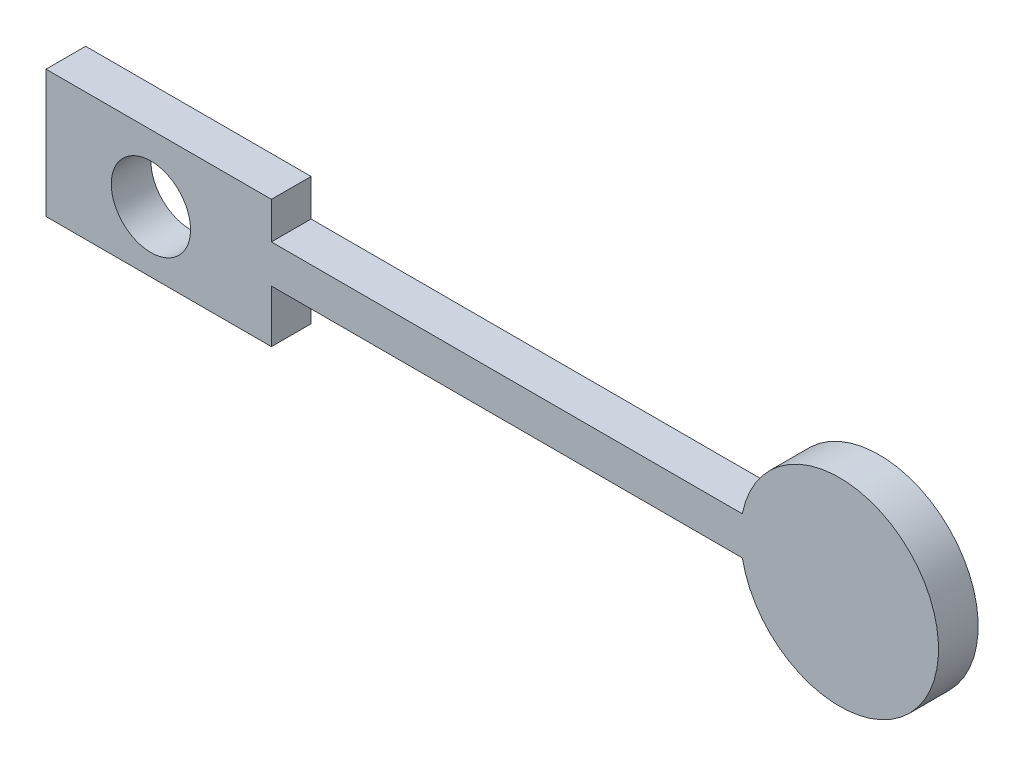
ISO-10303-21;
HEADER;
FILE_DESCRIPTION(('STEP AP214'),'2;1');
FILE_NAME('part.step','',(''),(''),'','','');
FILE_SCHEMA(('AUTOMOTIVE_DESIGN { 1 0 10303 214 1 1 1 1 }'));
ENDSEC;
DATA;
#1=APPLICATION_CONTEXT('core data for automotive mechanical design processes');
#2=APPLICATION_PROTOCOL_DEFINITION('international standard','automotive_design',2000,#1);
#3=PRODUCT_CONTEXT('',#1,'mechanical');
#4=PRODUCT('Part','Part','',(#3));
#5=PRODUCT_RELATED_PRODUCT_CATEGORY('part','',(#4));
#6=PRODUCT_DEFINITION_FORMATION('','',#4);
#7=PRODUCT_DEFINITION_CONTEXT('part definition',#1,'design');
#8=PRODUCT_DEFINITION('design','',#6,#7);
#9=PRODUCT_DEFINITION_SHAPE('','',#8);
#10=(LENGTH_UNIT() NAMED_UNIT(*) SI_UNIT(.MILLI.,.METRE.));
#11=(NAMED_UNIT(*) PLANE_ANGLE_UNIT() SI_UNIT($,.RADIAN.));
#12=(NAMED_UNIT(*) SI_UNIT($,.STERADIAN.) SOLID_ANGLE_UNIT());
#13=UNCERTAINTY_MEASURE_WITH_UNIT(LENGTH_MEASURE(1.E-05),#10,'distance_accuracy_value','');
#14=(GEOMETRIC_REPRESENTATION_CONTEXT(3) GLOBAL_UNCERTAINTY_ASSIGNED_CONTEXT((#13)) GLOBAL_UNIT_ASSIGNED_CONTEXT((#10,
#11,#12)) REPRESENTATION_CONTEXT('',''));
#15=CARTESIAN_POINT('',(0.,0.,0.));
#16=DIRECTION('',(0.,0.,1.));
#17=DIRECTION('',(1.,0.,0.));
#18=AXIS2_PLACEMENT_3D('',#15,#16,#17);
#19=CARTESIAN_POINT('',(173.72990017453,2.71115254064391,10.));
#20=DIRECTION('',(0.,0.,1.));
#21=DIRECTION('',(1.,0.,0.));
#22=AXIS2_PLACEMENT_3D('',#19,#20,#21);
#23=PLANE('',#22);
#24=DIRECTION('',(0.,-1.,0.));
#25=VECTOR('',#24,1.);
#26=CARTESIAN_POINT('',(-26.4633372645644,-15.3598391116003,10.));
#27=LINE('',#26,#25);
#28=CARTESIAN_POINT('',(-26.4633372645644,16.8403055319955,10.));
#29=VERTEX_POINT('',#28);
#30=CARTESIAN_POINT('',(-26.4633372645644,-15.3598391116003,10.));
#31=VERTEX_POINT('',#30);
#32=EDGE_CURVE('E147',#29,#31,#27,.T.);
#33=ORIENTED_EDGE('',*,*,#32,.T.);
#34=DIRECTION('',(1.,0.,0.));
#35=VECTOR('',#34,1.);
#36=CARTESIAN_POINT('',(-26.4633372645644,-15.3598391116003,10.));
#37=LINE('',#36,#35);
#38=CARTESIAN_POINT('',(30.4099834203681,-15.3598391116003,10.));
#39=VERTEX_POINT('',#38);
#40=EDGE_CURVE('E95',#31,#39,#37,.T.);
#41=ORIENTED_EDGE('',*,*,#40,.T.);
#42=DIRECTION('',(0.,1.,0.));
#43=VECTOR('',#42,1.);
#44=CARTESIAN_POINT('',(30.4099834203681,-15.3598391116003,10.));
#45=LINE('',#44,#43);
#46=CARTESIAN_POINT('',(30.4099834203681,-2.10831855037226,10.));
#47=VERTEX_POINT('',#46);
#48=EDGE_CURVE('E162',#39,#47,#45,.T.);
#49=ORIENTED_EDGE('',*,*,#48,.T.);
#50=DIRECTION('',(1.,0.,0.));
#51=VECTOR('',#50,1.);
#52=CARTESIAN_POINT('',(30.4099834203681,-2.10831855037226,10.));
#53=LINE('',#52,#51);
#54=CARTESIAN_POINT('',(149.211555261878,-2.10831855037226,10.));
#55=VERTEX_POINT('',#54);
#56=EDGE_CURVE('E175',#47,#55,#53,.T.);
#57=ORIENTED_EDGE('',*,*,#56,.T.);
#58=CARTESIAN_POINT('',(173.72990017453,2.71115254064391,10.));
#59=DIRECTION('',(0.,0.,1.));
#60=DIRECTION('',(1.,0.,0.));
#61=AXIS2_PLACEMENT_3D('',#58,#59,#60);
#62=CIRCLE('',#61,24.9875276658761);
#63=CARTESIAN_POINT('',(149.211555261878,7.53062363166009,10.));
#64=VERTEX_POINT('',#63);
#65=EDGE_CURVE('E114',#55,#64,#62,.T.);
#66=ORIENTED_EDGE('',*,*,#65,.T.);
#67=DIRECTION('',(-1.,0.,0.));
#68=VECTOR('',#67,1.);
#69=CARTESIAN_POINT('',(30.4099834203681,7.53062363166007,10.));
#70=LINE('',#69,#68);
#71=CARTESIAN_POINT('',(30.4099834203681,7.53062363166007,10.));
#72=VERTEX_POINT('',#71);
#73=EDGE_CURVE('E108',#64,#72,#70,.T.);
#74=ORIENTED_EDGE('',*,*,#73,.T.);
#75=DIRECTION('',(0.,1.,0.));
#76=VECTOR('',#75,1.);
#77=CARTESIAN_POINT('',(30.4099834203681,7.53062363166007,10.));
#78=LINE('',#77,#76);
#79=CARTESIAN_POINT('',(30.4099834203681,16.8403055319955,10.));
#80=VERTEX_POINT('',#79);
#81=EDGE_CURVE('E112',#72,#80,#78,.T.);
#82=ORIENTED_EDGE('',*,*,#81,.T.);
#83=DIRECTION('',(-1.,0.,0.));
#84=VECTOR('',#83,1.);
#85=CARTESIAN_POINT('',(-26.4633372645644,16.8403055319955,10.));
#86=LINE('',#85,#84);
#87=EDGE_CURVE('E52',#80,#29,#86,.T.);
#88=ORIENTED_EDGE('',*,*,#87,.T.);
#89=EDGE_LOOP('',(#33,#41,#49,#57,#66,#74,#82,#88));
#90=FACE_BOUND('',#89,.T.);
#91=CARTESIAN_POINT('',(0.,0.,10.));
#92=DIRECTION('',(0.,0.,1.));
#93=DIRECTION('',(1.,0.,0.));
#94=AXIS2_PLACEMENT_3D('',#91,#92,#93);
#95=CIRCLE('',#94,10.);
#96=CARTESIAN_POINT('',(10.,0.,10.));
#97=VERTEX_POINT('',#96);
#98=EDGE_CURVE('E136',#97,#97,#95,.T.);
#99=ORIENTED_EDGE('',*,*,#98,.F.);
#100=EDGE_LOOP('',(#99));
#101=FACE_BOUND('',#100,.T.);
#102=ADVANCED_FACE('F35',(#90,#101),#23,.T.);
#103=CARTESIAN_POINT('',(173.72990017453,2.71115254064391,0.));
#104=DIRECTION('',(0.,0.,1.));
#105=DIRECTION('',(1.,0.,0.));
#106=AXIS2_PLACEMENT_3D('',#103,#104,#105);
#107=PLANE('',#106);
#108=DIRECTION('',(0.,-1.,0.));
#109=VECTOR('',#108,1.);
#110=CARTESIAN_POINT('',(-26.4633372645644,-15.3598391116003,0.));
#111=LINE('',#110,#109);
#112=CARTESIAN_POINT('',(-26.4633372645644,16.8403055319955,0.));
#113=VERTEX_POINT('',#112);
#114=CARTESIAN_POINT('',(-26.4633372645644,-15.3598391116003,0.));
#115=VERTEX_POINT('',#114);
#116=EDGE_CURVE('E132',#113,#115,#111,.T.);
#117=ORIENTED_EDGE('',*,*,#116,.F.);
#118=DIRECTION('',(-1.,0.,0.));
#119=VECTOR('',#118,1.);
#120=CARTESIAN_POINT('',(-26.4633372645644,16.8403055319955,0.));
#121=LINE('',#120,#119);
#122=CARTESIAN_POINT('',(30.4099834203681,16.8403055319955,0.));
#123=VERTEX_POINT('',#122);
#124=EDGE_CURVE('E87',#123,#113,#121,.T.);
#125=ORIENTED_EDGE('',*,*,#124,.F.);
#126=DIRECTION('',(0.,1.,0.));
#127=VECTOR('',#126,1.);
#128=CARTESIAN_POINT('',(30.4099834203681,7.53062363166007,0.));
#129=LINE('',#128,#127);
#130=CARTESIAN_POINT('',(30.4099834203681,7.53062363166007,0.));
#131=VERTEX_POINT('',#130);
#132=EDGE_CURVE('E81',#131,#123,#129,.T.);
#133=ORIENTED_EDGE('',*,*,#132,.F.);
#134=DIRECTION('',(-1.,0.,0.));
#135=VECTOR('',#134,1.);
#136=CARTESIAN_POINT('',(30.4099834203681,7.53062363166007,0.));
#137=LINE('',#136,#135);
#138=CARTESIAN_POINT('',(149.211555261878,7.53062363166009,0.));
#139=VERTEX_POINT('',#138);
#140=EDGE_CURVE('E122',#139,#131,#137,.T.);
#141=ORIENTED_EDGE('',*,*,#140,.F.);
#142=CARTESIAN_POINT('',(173.72990017453,2.71115254064391,0.));
#143=DIRECTION('',(0.,0.,1.));
#144=DIRECTION('',(1.,0.,0.));
#145=AXIS2_PLACEMENT_3D('',#142,#143,#144);
#146=CIRCLE('',#145,24.9875276658761);
#147=CARTESIAN_POINT('',(149.211555261878,-2.10831855037226,0.));
#148=VERTEX_POINT('',#147);
#149=EDGE_CURVE('E142',#148,#139,#146,.T.);
#150=ORIENTED_EDGE('',*,*,#149,.F.);
#151=DIRECTION('',(1.,0.,0.));
#152=VECTOR('',#151,1.);
#153=CARTESIAN_POINT('',(30.4099834203681,-2.10831855037226,0.));
#154=LINE('',#153,#152);
#155=CARTESIAN_POINT('',(30.4099834203681,-2.10831855037226,0.));
#156=VERTEX_POINT('',#155);
#157=EDGE_CURVE('E140',#156,#148,#154,.T.);
#158=ORIENTED_EDGE('',*,*,#157,.F.);
#159=DIRECTION('',(0.,1.,0.));
#160=VECTOR('',#159,1.);
#161=CARTESIAN_POINT('',(30.4099834203681,-15.3598391116003,0.));
#162=LINE('',#161,#160);
#163=CARTESIAN_POINT('',(30.4099834203681,-15.3598391116003,0.));
#164=VERTEX_POINT('',#163);
#165=EDGE_CURVE('E138',#164,#156,#162,.T.);
#166=ORIENTED_EDGE('',*,*,#165,.F.);
#167=DIRECTION('',(1.,0.,0.));
#168=VECTOR('',#167,1.);
#169=CARTESIAN_POINT('',(-26.4633372645644,-15.3598391116003,0.));
#170=LINE('',#169,#168);
#171=EDGE_CURVE('E135',#115,#164,#170,.T.);
#172=ORIENTED_EDGE('',*,*,#171,.F.);
#173=EDGE_LOOP('',(#117,#125,#133,#141,#150,#158,#166,#172));
#174=FACE_BOUND('',#173,.T.);
#175=CARTESIAN_POINT('',(0.,0.,0.));
#176=DIRECTION('',(0.,0.,1.));
#177=DIRECTION('',(1.,0.,0.));
#178=AXIS2_PLACEMENT_3D('',#175,#176,#177);
#179=CIRCLE('',#178,10.);
#180=CARTESIAN_POINT('',(10.,0.,0.));
#181=VERTEX_POINT('',#180);
#182=EDGE_CURVE('E181',#181,#181,#179,.T.);
#183=ORIENTED_EDGE('',*,*,#182,.T.);
#184=EDGE_LOOP('',(#183));
#185=FACE_BOUND('',#184,.T.);
#186=ADVANCED_FACE('F166',(#174,#185),#107,.F.);
#187=CARTESIAN_POINT('',(-26.4633372645644,-15.3598391116003,10.));
#188=DIRECTION('',(1.,0.,0.));
#189=DIRECTION('',(0.,0.,-1.));
#190=AXIS2_PLACEMENT_3D('',#187,#188,#189);
#191=PLANE('',#190);
#192=ORIENTED_EDGE('',*,*,#116,.T.);
#193=DIRECTION('',(0.,0.,-1.));
#194=VECTOR('',#193,1.);
#195=CARTESIAN_POINT('',(-26.4633372645644,-15.3598391116003,10.));
#196=LINE('',#195,#194);
#197=EDGE_CURVE('E11',#31,#115,#196,.T.);
#198=ORIENTED_EDGE('',*,*,#197,.F.);
#199=ORIENTED_EDGE('',*,*,#32,.F.);
#200=DIRECTION('',(0.,0.,-1.));
#201=VECTOR('',#200,1.);
#202=CARTESIAN_POINT('',(-26.4633372645644,16.8403055319955,10.));
#203=LINE('',#202,#201);
#204=EDGE_CURVE('E128',#29,#113,#203,.T.);
#205=ORIENTED_EDGE('',*,*,#204,.T.);
#206=EDGE_LOOP('',(#192,#198,#199,#205));
#207=FACE_BOUND('',#206,.T.);
#208=ADVANCED_FACE('F37',(#207),#191,.F.);
#209=CARTESIAN_POINT('',(-26.4633372645644,-15.3598391116003,10.));
#210=DIRECTION('',(0.,1.,0.));
#211=DIRECTION('',(0.,0.,1.));
#212=AXIS2_PLACEMENT_3D('',#209,#210,#211);
#213=PLANE('',#212);
#214=ORIENTED_EDGE('',*,*,#171,.T.);
#215=DIRECTION('',(0.,0.,-1.));
#216=VECTOR('',#215,1.);
#217=CARTESIAN_POINT('',(30.4099834203681,-15.3598391116003,10.));
#218=LINE('',#217,#216);
#219=EDGE_CURVE('E44',#39,#164,#218,.T.);
#220=ORIENTED_EDGE('',*,*,#219,.F.);
#221=ORIENTED_EDGE('',*,*,#40,.F.);
#222=ORIENTED_EDGE('',*,*,#197,.T.);
#223=EDGE_LOOP('',(#214,#220,#221,#222));
#224=FACE_BOUND('',#223,.T.);
#225=ADVANCED_FACE('F209',(#224),#213,.F.);
#226=CARTESIAN_POINT('',(30.4099834203681,-15.3598391116003,10.));
#227=DIRECTION('',(-1.,0.,0.));
#228=DIRECTION('',(0.,0.,1.));
#229=AXIS2_PLACEMENT_3D('',#226,#227,#228);
#230=PLANE('',#229);
#231=ORIENTED_EDGE('',*,*,#165,.T.);
#232=DIRECTION('',(0.,0.,-1.));
#233=VECTOR('',#232,1.);
#234=CARTESIAN_POINT('',(30.4099834203681,-2.10831855037226,10.));
#235=LINE('',#234,#233);
#236=EDGE_CURVE('E154',#47,#156,#235,.T.);
#237=ORIENTED_EDGE('',*,*,#236,.F.);
#238=ORIENTED_EDGE('',*,*,#48,.F.);
#239=ORIENTED_EDGE('',*,*,#219,.T.);
#240=EDGE_LOOP('',(#231,#237,#238,#239));
#241=FACE_BOUND('',#240,.T.);
#242=ADVANCED_FACE('F160',(#241),#230,.F.);
#243=CARTESIAN_POINT('',(30.4099834203681,-2.10831855037226,10.));
#244=DIRECTION('',(0.,1.,0.));
#245=DIRECTION('',(0.,0.,1.));
#246=AXIS2_PLACEMENT_3D('',#243,#244,#245);
#247=PLANE('',#246);
#248=ORIENTED_EDGE('',*,*,#157,.T.);
#249=DIRECTION('',(0.,0.,-1.));
#250=VECTOR('',#249,1.);
#251=CARTESIAN_POINT('',(149.211555261878,-2.10831855037226,10.));
#252=LINE('',#251,#250);
#253=EDGE_CURVE('E151',#55,#148,#252,.T.);
#254=ORIENTED_EDGE('',*,*,#253,.F.);
#255=ORIENTED_EDGE('',*,*,#56,.F.);
#256=ORIENTED_EDGE('',*,*,#236,.T.);
#257=EDGE_LOOP('',(#248,#254,#255,#256));
#258=FACE_BOUND('',#257,.T.);
#259=ADVANCED_FACE('F171',(#258),#247,.F.);
#260=CARTESIAN_POINT('',(173.72990017453,2.71115254064391,10.));
#261=DIRECTION('',(0.,0.,-1.));
#262=DIRECTION('',(-1.,0.,0.));
#263=AXIS2_PLACEMENT_3D('',#260,#261,#262);
#264=CYLINDRICAL_SURFACE('',#263,24.9875276658761);
#265=ORIENTED_EDGE('',*,*,#149,.T.);
#266=DIRECTION('',(0.,0.,-1.));
#267=VECTOR('',#266,1.);
#268=CARTESIAN_POINT('',(149.211555261878,7.53062363166009,10.));
#269=LINE('',#268,#267);
#270=EDGE_CURVE('E123',#64,#139,#269,.T.);
#271=ORIENTED_EDGE('',*,*,#270,.F.);
#272=ORIENTED_EDGE('',*,*,#65,.F.);
#273=ORIENTED_EDGE('',*,*,#253,.T.);
#274=EDGE_LOOP('',(#265,#271,#272,#273));
#275=FACE_BOUND('',#274,.T.);
#276=ADVANCED_FACE('F174',(#275),#264,.T.);
#277=CARTESIAN_POINT('',(30.4099834203681,7.53062363166007,10.));
#278=DIRECTION('',(0.,-1.,0.));
#279=DIRECTION('',(0.,0.,-1.));
#280=AXIS2_PLACEMENT_3D('',#277,#278,#279);
#281=PLANE('',#280);
#282=ORIENTED_EDGE('',*,*,#140,.T.);
#283=DIRECTION('',(0.,0.,-1.));
#284=VECTOR('',#283,1.);
#285=CARTESIAN_POINT('',(30.4099834203681,7.53062363166007,10.));
#286=LINE('',#285,#284);
#287=EDGE_CURVE('E119',#72,#131,#286,.T.);
#288=ORIENTED_EDGE('',*,*,#287,.F.);
#289=ORIENTED_EDGE('',*,*,#73,.F.);
#290=ORIENTED_EDGE('',*,*,#270,.T.);
#291=EDGE_LOOP('',(#282,#288,#289,#290));
#292=FACE_BOUND('',#291,.T.);
#293=ADVANCED_FACE('F120',(#292),#281,.F.);
#294=CARTESIAN_POINT('',(30.4099834203681,7.53062363166007,10.));
#295=DIRECTION('',(-1.,0.,0.));
#296=DIRECTION('',(0.,0.,1.));
#297=AXIS2_PLACEMENT_3D('',#294,#295,#296);
#298=PLANE('',#297);
#299=ORIENTED_EDGE('',*,*,#132,.T.);
#300=DIRECTION('',(0.,0.,-1.));
#301=VECTOR('',#300,1.);
#302=CARTESIAN_POINT('',(30.4099834203681,16.8403055319955,10.));
#303=LINE('',#302,#301);
#304=EDGE_CURVE('E124',#80,#123,#303,.T.);
#305=ORIENTED_EDGE('',*,*,#304,.F.);
#306=ORIENTED_EDGE('',*,*,#81,.F.);
#307=ORIENTED_EDGE('',*,*,#287,.T.);
#308=EDGE_LOOP('',(#299,#305,#306,#307));
#309=FACE_BOUND('',#308,.T.);
#310=ADVANCED_FACE('F126',(#309),#298,.F.);
#311=CARTESIAN_POINT('',(-26.4633372645644,16.8403055319955,10.));
#312=DIRECTION('',(0.,-1.,0.));
#313=DIRECTION('',(0.,0.,-1.));
#314=AXIS2_PLACEMENT_3D('',#311,#312,#313);
#315=PLANE('',#314);
#316=ORIENTED_EDGE('',*,*,#124,.T.);
#317=ORIENTED_EDGE('',*,*,#204,.F.);
#318=ORIENTED_EDGE('',*,*,#87,.F.);
#319=ORIENTED_EDGE('',*,*,#304,.T.);
#320=EDGE_LOOP('',(#316,#317,#318,#319));
#321=FACE_BOUND('',#320,.T.);
#322=ADVANCED_FACE('F197',(#321),#315,.F.);
#323=CARTESIAN_POINT('',(0.,0.,10.));
#324=DIRECTION('',(0.,0.,-1.));
#325=DIRECTION('',(-1.,0.,0.));
#326=AXIS2_PLACEMENT_3D('',#323,#324,#325);
#327=CYLINDRICAL_SURFACE('',#326,10.);
#328=ORIENTED_EDGE('',*,*,#98,.T.);
#329=EDGE_LOOP('',(#328));
#330=FACE_BOUND('',#329,.T.);
#331=ORIENTED_EDGE('',*,*,#182,.F.);
#332=EDGE_LOOP('',(#331));
#333=FACE_BOUND('',#332,.T.);
#334=ADVANCED_FACE('F187',(#330,#333),#327,.F.);
#335=CLOSED_SHELL('',(#102,#186,#208,#225,#242,#259,#276,#293,#310,#322,#334));
#336=MANIFOLD_SOLID_BREP('B2',#335);
#337=ADVANCED_BREP_SHAPE_REPRESENTATION('',(#18,#336),#14);
#338=SHAPE_DEFINITION_REPRESENTATION(#9,#337);
ENDSEC;
END-ISO-10303-21;
